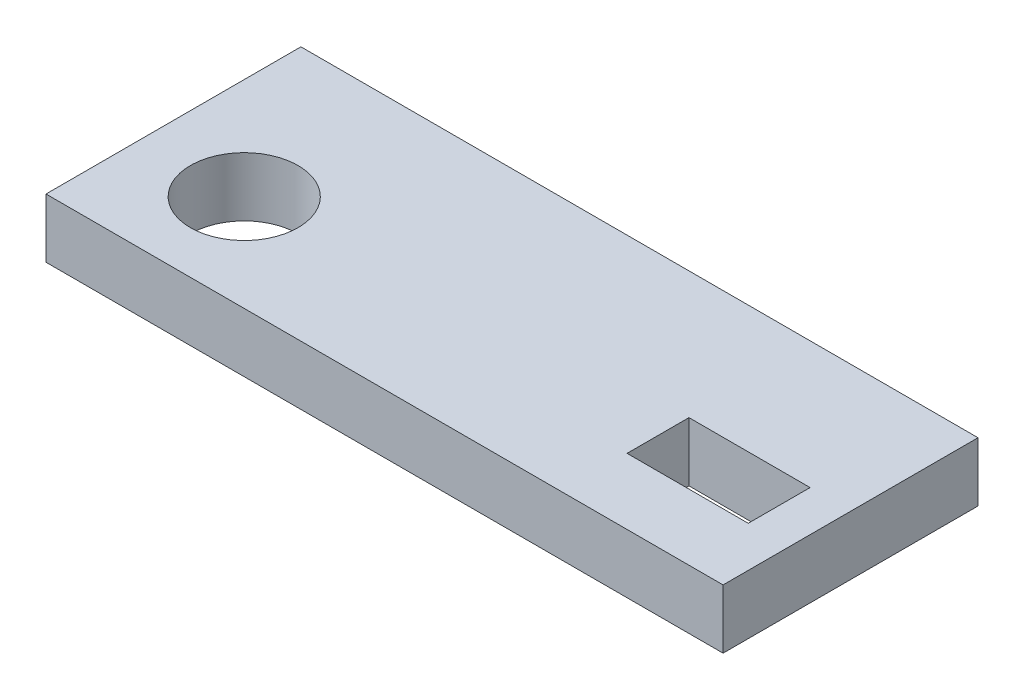
ISO-10303-21;
HEADER;
FILE_DESCRIPTION(('STEP AP214'),'2;1');
FILE_NAME('part.step','',(''),(''),'','','');
FILE_SCHEMA(('AUTOMOTIVE_DESIGN { 1 0 10303 214 1 1 1 1 }'));
ENDSEC;
DATA;
#1=APPLICATION_CONTEXT('core data for automotive mechanical design processes');
#2=APPLICATION_PROTOCOL_DEFINITION('international standard','automotive_design',2000,#1);
#3=PRODUCT_CONTEXT('',#1,'mechanical');
#4=PRODUCT('Part','Part','',(#3));
#5=PRODUCT_RELATED_PRODUCT_CATEGORY('part','',(#4));
#6=PRODUCT_DEFINITION_FORMATION('','',#4);
#7=PRODUCT_DEFINITION_CONTEXT('part definition',#1,'design');
#8=PRODUCT_DEFINITION('design','',#6,#7);
#9=PRODUCT_DEFINITION_SHAPE('','',#8);
#10=(LENGTH_UNIT() NAMED_UNIT(*) SI_UNIT(.MILLI.,.METRE.));
#11=(NAMED_UNIT(*) PLANE_ANGLE_UNIT() SI_UNIT($,.RADIAN.));
#12=(NAMED_UNIT(*) SI_UNIT($,.STERADIAN.) SOLID_ANGLE_UNIT());
#13=UNCERTAINTY_MEASURE_WITH_UNIT(LENGTH_MEASURE(1.E-05),#10,'distance_accuracy_value','');
#14=(GEOMETRIC_REPRESENTATION_CONTEXT(3) GLOBAL_UNCERTAINTY_ASSIGNED_CONTEXT((#13)) GLOBAL_UNIT_ASSIGNED_CONTEXT((#10,
#11,#12)) REPRESENTATION_CONTEXT('',''));
#15=CARTESIAN_POINT('',(0.,0.,0.));
#16=DIRECTION('',(0.,0.,1.));
#17=DIRECTION('',(1.,0.,0.));
#18=AXIS2_PLACEMENT_3D('',#15,#16,#17);
#19=CARTESIAN_POINT('',(0.,0.,25.000000038));
#20=DIRECTION('',(0.,0.,1.));
#21=DIRECTION('',(1.,0.,0.));
#22=AXIS2_PLACEMENT_3D('',#19,#20,#21);
#23=PLANE('',#22);
#24=DIRECTION('',(0.,1.,0.));
#25=VECTOR('',#24,1.);
#26=CARTESIAN_POINT('',(-33.2,-62.5,25.000000038));
#27=LINE('',#26,#25);
#28=CARTESIAN_POINT('',(-33.2,-62.5,25.000000038));
#29=VERTEX_POINT('',#28);
#30=CARTESIAN_POINT('',(-33.2,-56.7,25.000000038));
#31=VERTEX_POINT('',#30);
#32=EDGE_CURVE('E40',#29,#31,#27,.T.);
#33=ORIENTED_EDGE('',*,*,#32,.F.);
#34=DIRECTION('',(1.,0.,0.));
#35=VECTOR('',#34,1.);
#36=CARTESIAN_POINT('',(-33.2,-62.5,25.000000038));
#37=LINE('',#36,#35);
#38=CARTESIAN_POINT('',(33.2,-62.5,25.000000038));
#39=VERTEX_POINT('',#38);
#40=EDGE_CURVE('E130',#29,#39,#37,.T.);
#41=ORIENTED_EDGE('',*,*,#40,.T.);
#42=DIRECTION('',(0.,1.,0.));
#43=VECTOR('',#42,1.);
#44=CARTESIAN_POINT('',(33.2,-62.5,25.000000038));
#45=LINE('',#44,#43);
#46=CARTESIAN_POINT('',(33.2,-56.7,25.000000038));
#47=VERTEX_POINT('',#46);
#48=EDGE_CURVE('E154',#39,#47,#45,.T.);
#49=ORIENTED_EDGE('',*,*,#48,.T.);
#50=DIRECTION('',(1.,0.,0.));
#51=VECTOR('',#50,1.);
#52=CARTESIAN_POINT('',(-33.2,-56.7,25.000000038));
#53=LINE('',#52,#51);
#54=EDGE_CURVE('E150',#31,#47,#53,.T.);
#55=ORIENTED_EDGE('',*,*,#54,.F.);
#56=EDGE_LOOP('',(#33,#41,#49,#55));
#57=FACE_BOUND('',#56,.T.);
#58=ADVANCED_FACE('F33',(#57),#23,.T.);
#59=CARTESIAN_POINT('',(0.,0.,0.));
#60=DIRECTION('',(0.,0.,-1.));
#61=DIRECTION('',(-1.,0.,0.));
#62=AXIS2_PLACEMENT_3D('',#59,#60,#61);
#63=PLANE('',#62);
#64=DIRECTION('',(0.,1.,0.));
#65=VECTOR('',#64,1.);
#66=CARTESIAN_POINT('',(-33.2,-62.5,0.));
#67=LINE('',#66,#65);
#68=CARTESIAN_POINT('',(-33.2,-62.5,0.));
#69=VERTEX_POINT('',#68);
#70=CARTESIAN_POINT('',(-33.2,-56.7,0.));
#71=VERTEX_POINT('',#70);
#72=EDGE_CURVE('E151',#69,#71,#67,.T.);
#73=ORIENTED_EDGE('',*,*,#72,.T.);
#74=DIRECTION('',(1.,0.,0.));
#75=VECTOR('',#74,1.);
#76=CARTESIAN_POINT('',(-33.2,-56.7,0.));
#77=LINE('',#76,#75);
#78=CARTESIAN_POINT('',(33.2,-56.7,0.));
#79=VERTEX_POINT('',#78);
#80=EDGE_CURVE('E147',#71,#79,#77,.T.);
#81=ORIENTED_EDGE('',*,*,#80,.T.);
#82=DIRECTION('',(0.,1.,0.));
#83=VECTOR('',#82,1.);
#84=CARTESIAN_POINT('',(33.2,-62.5,0.));
#85=LINE('',#84,#83);
#86=CARTESIAN_POINT('',(33.2,-62.5,0.));
#87=VERTEX_POINT('',#86);
#88=EDGE_CURVE('E143',#87,#79,#85,.T.);
#89=ORIENTED_EDGE('',*,*,#88,.F.);
#90=DIRECTION('',(1.,0.,0.));
#91=VECTOR('',#90,1.);
#92=CARTESIAN_POINT('',(-33.2,-62.5,0.));
#93=LINE('',#92,#91);
#94=EDGE_CURVE('E139',#69,#87,#93,.T.);
#95=ORIENTED_EDGE('',*,*,#94,.F.);
#96=EDGE_LOOP('',(#73,#81,#89,#95));
#97=FACE_BOUND('',#96,.T.);
#98=ADVANCED_FACE('F175',(#97),#63,.T.);
#99=CARTESIAN_POINT('',(-33.2,-56.7,91.6528319358271));
#100=DIRECTION('',(0.,1.,0.));
#101=DIRECTION('',(0.,0.,1.));
#102=AXIS2_PLACEMENT_3D('',#99,#100,#101);
#103=PLANE('',#102);
#104=DIRECTION('',(0.,0.,1.));
#105=VECTOR('',#104,1.);
#106=CARTESIAN_POINT('',(17.32,-56.7,18.535000019));
#107=LINE('',#106,#105);
#108=CARTESIAN_POINT('',(17.32,-56.7,12.465000019));
#109=VERTEX_POINT('',#108);
#110=CARTESIAN_POINT('',(17.32,-56.7,18.535000019));
#111=VERTEX_POINT('',#110);
#112=EDGE_CURVE('E47',#109,#111,#107,.T.);
#113=ORIENTED_EDGE('',*,*,#112,.F.);
#114=DIRECTION('',(-1.,0.,0.));
#115=VECTOR('',#114,1.);
#116=CARTESIAN_POINT('',(29.2,-56.7,12.465000019));
#117=LINE('',#116,#115);
#118=CARTESIAN_POINT('',(29.2,-56.7,12.465000019));
#119=VERTEX_POINT('',#118);
#120=EDGE_CURVE('E114',#119,#109,#117,.T.);
#121=ORIENTED_EDGE('',*,*,#120,.F.);
#122=DIRECTION('',(0.,0.,-1.));
#123=VECTOR('',#122,1.);
#124=CARTESIAN_POINT('',(29.2,-56.7,18.535000019));
#125=LINE('',#124,#123);
#126=CARTESIAN_POINT('',(29.2,-56.7,18.535000019));
#127=VERTEX_POINT('',#126);
#128=EDGE_CURVE('E117',#127,#119,#125,.T.);
#129=ORIENTED_EDGE('',*,*,#128,.F.);
#130=DIRECTION('',(1.,0.,0.));
#131=VECTOR('',#130,1.);
#132=CARTESIAN_POINT('',(29.2,-56.7,18.535000019));
#133=LINE('',#132,#131);
#134=EDGE_CURVE('E123',#111,#127,#133,.T.);
#135=ORIENTED_EDGE('',*,*,#134,.F.);
#136=EDGE_LOOP('',(#113,#121,#129,#135));
#137=FACE_BOUND('',#136,.T.);
#138=CARTESIAN_POINT('',(-23.26,-56.7,15.500000019));
#139=DIRECTION('',(0.,1.,0.));
#140=DIRECTION('',(0.,0.,1.));
#141=AXIS2_PLACEMENT_3D('',#138,#139,#140);
#142=CIRCLE('',#141,5.28);
#143=CARTESIAN_POINT('',(-23.26,-56.7,20.780000019));
#144=VERTEX_POINT('',#143);
#145=EDGE_CURVE('E136',#144,#144,#142,.T.);
#146=ORIENTED_EDGE('',*,*,#145,.F.);
#147=EDGE_LOOP('',(#146));
#148=FACE_BOUND('',#147,.T.);
#149=DIRECTION('',(0.,0.,-1.));
#150=VECTOR('',#149,1.);
#151=CARTESIAN_POINT('',(-33.2,-56.7,91.6528319358271));
#152=LINE('',#151,#150);
#153=EDGE_CURVE('E11',#31,#71,#152,.T.);
#154=ORIENTED_EDGE('',*,*,#153,.F.);
#155=ORIENTED_EDGE('',*,*,#54,.T.);
#156=DIRECTION('',(0.,0.,-1.));
#157=VECTOR('',#156,1.);
#158=CARTESIAN_POINT('',(33.2,-56.7,91.6528319358271));
#159=LINE('',#158,#157);
#160=EDGE_CURVE('E157',#47,#79,#159,.T.);
#161=ORIENTED_EDGE('',*,*,#160,.T.);
#162=ORIENTED_EDGE('',*,*,#80,.F.);
#163=EDGE_LOOP('',(#154,#155,#161,#162));
#164=FACE_BOUND('',#163,.T.);
#165=ADVANCED_FACE('F167',(#137,#148,#164),#103,.T.);
#166=CARTESIAN_POINT('',(33.2,-62.5,91.6528319358271));
#167=DIRECTION('',(-1.,0.,0.));
#168=DIRECTION('',(0.,0.,1.));
#169=AXIS2_PLACEMENT_3D('',#166,#167,#168);
#170=PLANE('',#169);
#171=ORIENTED_EDGE('',*,*,#48,.F.);
#172=DIRECTION('',(0.,0.,-1.));
#173=VECTOR('',#172,1.);
#174=CARTESIAN_POINT('',(33.2,-62.5,91.6528319358271));
#175=LINE('',#174,#173);
#176=EDGE_CURVE('E146',#39,#87,#175,.T.);
#177=ORIENTED_EDGE('',*,*,#176,.T.);
#178=ORIENTED_EDGE('',*,*,#88,.T.);
#179=ORIENTED_EDGE('',*,*,#160,.F.);
#180=EDGE_LOOP('',(#171,#177,#178,#179));
#181=FACE_BOUND('',#180,.T.);
#182=ADVANCED_FACE('F171',(#181),#170,.F.);
#183=CARTESIAN_POINT('',(-33.2,-62.5,91.6528319358271));
#184=DIRECTION('',(0.,1.,0.));
#185=DIRECTION('',(0.,0.,1.));
#186=AXIS2_PLACEMENT_3D('',#183,#184,#185);
#187=PLANE('',#186);
#188=DIRECTION('',(-1.,0.,0.));
#189=VECTOR('',#188,1.);
#190=CARTESIAN_POINT('',(29.2,-62.5,12.465000019));
#191=LINE('',#190,#189);
#192=CARTESIAN_POINT('',(29.2,-62.5,12.465000019));
#193=VERTEX_POINT('',#192);
#194=CARTESIAN_POINT('',(17.32,-62.5,12.465000019));
#195=VERTEX_POINT('',#194);
#196=EDGE_CURVE('E104',#193,#195,#191,.T.);
#197=ORIENTED_EDGE('',*,*,#196,.T.);
#198=DIRECTION('',(0.,0.,1.));
#199=VECTOR('',#198,1.);
#200=CARTESIAN_POINT('',(17.32,-62.5,18.535000019));
#201=LINE('',#200,#199);
#202=CARTESIAN_POINT('',(17.32,-62.5,18.535000019));
#203=VERTEX_POINT('',#202);
#204=EDGE_CURVE('E98',#195,#203,#201,.T.);
#205=ORIENTED_EDGE('',*,*,#204,.T.);
#206=DIRECTION('',(1.,0.,0.));
#207=VECTOR('',#206,1.);
#208=CARTESIAN_POINT('',(29.2,-62.5,18.535000019));
#209=LINE('',#208,#207);
#210=CARTESIAN_POINT('',(29.2,-62.5,18.535000019));
#211=VERTEX_POINT('',#210);
#212=EDGE_CURVE('E107',#203,#211,#209,.T.);
#213=ORIENTED_EDGE('',*,*,#212,.T.);
#214=DIRECTION('',(0.,0.,-1.));
#215=VECTOR('',#214,1.);
#216=CARTESIAN_POINT('',(29.2,-62.5,18.535000019));
#217=LINE('',#216,#215);
#218=EDGE_CURVE('E55',#211,#193,#217,.T.);
#219=ORIENTED_EDGE('',*,*,#218,.T.);
#220=EDGE_LOOP('',(#197,#205,#213,#219));
#221=FACE_BOUND('',#220,.T.);
#222=CARTESIAN_POINT('',(-23.26,-62.5,15.500000019));
#223=DIRECTION('',(0.,1.,0.));
#224=DIRECTION('',(0.,0.,1.));
#225=AXIS2_PLACEMENT_3D('',#222,#223,#224);
#226=CIRCLE('',#225,5.28);
#227=CARTESIAN_POINT('',(-23.26,-62.5,20.780000019));
#228=VERTEX_POINT('',#227);
#229=EDGE_CURVE('E124',#228,#228,#226,.T.);
#230=ORIENTED_EDGE('',*,*,#229,.T.);
#231=EDGE_LOOP('',(#230));
#232=FACE_BOUND('',#231,.T.);
#233=ORIENTED_EDGE('',*,*,#40,.F.);
#234=DIRECTION('',(0.,0.,-1.));
#235=VECTOR('',#234,1.);
#236=CARTESIAN_POINT('',(-33.2,-62.5,91.6528319358271));
#237=LINE('',#236,#235);
#238=EDGE_CURVE('E142',#29,#69,#237,.T.);
#239=ORIENTED_EDGE('',*,*,#238,.T.);
#240=ORIENTED_EDGE('',*,*,#94,.T.);
#241=ORIENTED_EDGE('',*,*,#176,.F.);
#242=EDGE_LOOP('',(#233,#239,#240,#241));
#243=FACE_BOUND('',#242,.T.);
#244=ADVANCED_FACE('F111',(#221,#232,#243),#187,.F.);
#245=CARTESIAN_POINT('',(-33.2,-62.5,91.6528319358271));
#246=DIRECTION('',(-1.,0.,0.));
#247=DIRECTION('',(0.,0.,1.));
#248=AXIS2_PLACEMENT_3D('',#245,#246,#247);
#249=PLANE('',#248);
#250=ORIENTED_EDGE('',*,*,#238,.F.);
#251=ORIENTED_EDGE('',*,*,#32,.T.);
#252=ORIENTED_EDGE('',*,*,#153,.T.);
#253=ORIENTED_EDGE('',*,*,#72,.F.);
#254=EDGE_LOOP('',(#250,#251,#252,#253));
#255=FACE_BOUND('',#254,.T.);
#256=ADVANCED_FACE('F179',(#255),#249,.T.);
#257=CARTESIAN_POINT('',(-23.26,-62.5,15.500000019));
#258=DIRECTION('',(0.,1.,0.));
#259=DIRECTION('',(0.,0.,1.));
#260=AXIS2_PLACEMENT_3D('',#257,#258,#259);
#261=CYLINDRICAL_SURFACE('',#260,5.28);
#262=ORIENTED_EDGE('',*,*,#229,.F.);
#263=EDGE_LOOP('',(#262));
#264=FACE_BOUND('',#263,.T.);
#265=ORIENTED_EDGE('',*,*,#145,.T.);
#266=EDGE_LOOP('',(#265));
#267=FACE_BOUND('',#266,.T.);
#268=ADVANCED_FACE('F190',(#264,#267),#261,.F.);
#269=CARTESIAN_POINT('',(17.32,-62.5,18.535000019));
#270=DIRECTION('',(-1.,0.,0.));
#271=DIRECTION('',(0.,0.,1.));
#272=AXIS2_PLACEMENT_3D('',#269,#270,#271);
#273=PLANE('',#272);
#274=ORIENTED_EDGE('',*,*,#112,.T.);
#275=DIRECTION('',(0.,1.,0.));
#276=VECTOR('',#275,1.);
#277=CARTESIAN_POINT('',(17.32,-62.5,18.535000019));
#278=LINE('',#277,#276);
#279=EDGE_CURVE('E94',#203,#111,#278,.T.);
#280=ORIENTED_EDGE('',*,*,#279,.F.);
#281=ORIENTED_EDGE('',*,*,#204,.F.);
#282=DIRECTION('',(0.,1.,0.));
#283=VECTOR('',#282,1.);
#284=CARTESIAN_POINT('',(17.32,-62.5,12.465000019));
#285=LINE('',#284,#283);
#286=EDGE_CURVE('E128',#195,#109,#285,.T.);
#287=ORIENTED_EDGE('',*,*,#286,.T.);
#288=EDGE_LOOP('',(#274,#280,#281,#287));
#289=FACE_BOUND('',#288,.T.);
#290=ADVANCED_FACE('F96',(#289),#273,.F.);
#291=CARTESIAN_POINT('',(29.2,-62.5,12.465000019));
#292=DIRECTION('',(0.,0.,-1.));
#293=DIRECTION('',(-1.,0.,0.));
#294=AXIS2_PLACEMENT_3D('',#291,#292,#293);
#295=PLANE('',#294);
#296=ORIENTED_EDGE('',*,*,#120,.T.);
#297=ORIENTED_EDGE('',*,*,#286,.F.);
#298=ORIENTED_EDGE('',*,*,#196,.F.);
#299=DIRECTION('',(0.,1.,0.));
#300=VECTOR('',#299,1.);
#301=CARTESIAN_POINT('',(29.2,-62.5,12.465000019));
#302=LINE('',#301,#300);
#303=EDGE_CURVE('E131',#193,#119,#302,.T.);
#304=ORIENTED_EDGE('',*,*,#303,.T.);
#305=EDGE_LOOP('',(#296,#297,#298,#304));
#306=FACE_BOUND('',#305,.T.);
#307=ADVANCED_FACE('F209',(#306),#295,.F.);
#308=CARTESIAN_POINT('',(29.2,-62.5,18.535000019));
#309=DIRECTION('',(1.,0.,0.));
#310=DIRECTION('',(0.,0.,-1.));
#311=AXIS2_PLACEMENT_3D('',#308,#309,#310);
#312=PLANE('',#311);
#313=ORIENTED_EDGE('',*,*,#128,.T.);
#314=ORIENTED_EDGE('',*,*,#303,.F.);
#315=ORIENTED_EDGE('',*,*,#218,.F.);
#316=DIRECTION('',(0.,1.,0.));
#317=VECTOR('',#316,1.);
#318=CARTESIAN_POINT('',(29.2,-62.5,18.535000019));
#319=LINE('',#318,#317);
#320=EDGE_CURVE('E103',#211,#127,#319,.T.);
#321=ORIENTED_EDGE('',*,*,#320,.T.);
#322=EDGE_LOOP('',(#313,#314,#315,#321));
#323=FACE_BOUND('',#322,.T.);
#324=ADVANCED_FACE('F212',(#323),#312,.F.);
#325=CARTESIAN_POINT('',(29.2,-62.5,18.535000019));
#326=DIRECTION('',(0.,0.,1.));
#327=DIRECTION('',(1.,0.,0.));
#328=AXIS2_PLACEMENT_3D('',#325,#326,#327);
#329=PLANE('',#328);
#330=ORIENTED_EDGE('',*,*,#134,.T.);
#331=ORIENTED_EDGE('',*,*,#320,.F.);
#332=ORIENTED_EDGE('',*,*,#212,.F.);
#333=ORIENTED_EDGE('',*,*,#279,.T.);
#334=EDGE_LOOP('',(#330,#331,#332,#333));
#335=FACE_BOUND('',#334,.T.);
#336=ADVANCED_FACE('F108',(#335),#329,.F.);
#337=CLOSED_SHELL('',(#58,#98,#165,#182,#244,#256,#268,#290,#307,#324,#336));
#338=MANIFOLD_SOLID_BREP('B2',#337);
#339=ADVANCED_BREP_SHAPE_REPRESENTATION('',(#18,#338),#14);
#340=SHAPE_DEFINITION_REPRESENTATION(#9,#339);
ENDSEC;
END-ISO-10303-21;
